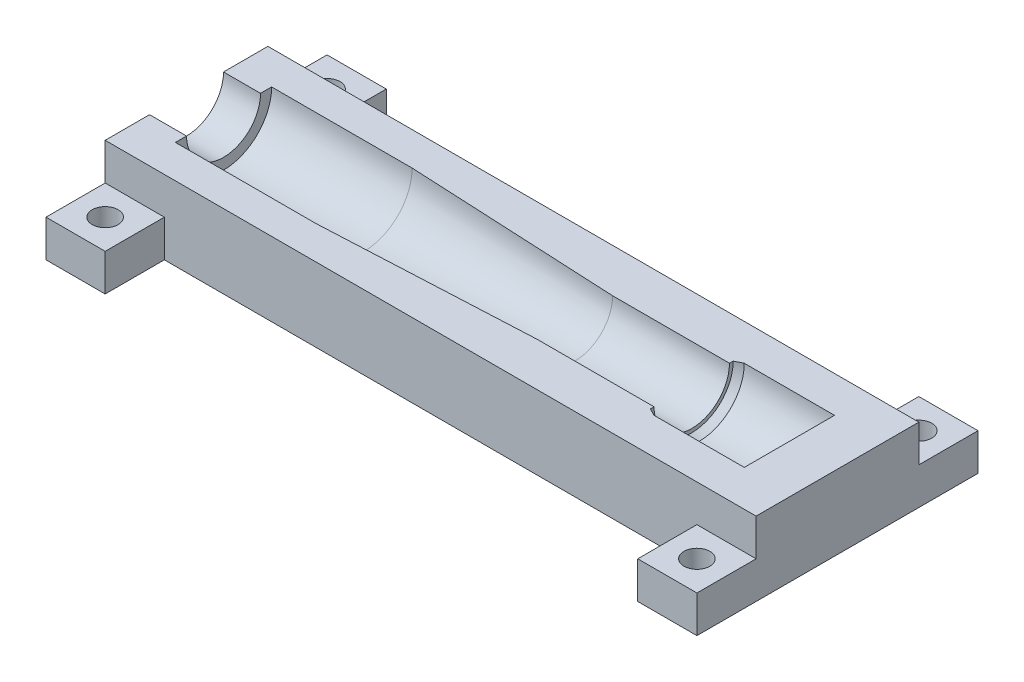
ISO-10303-21;
HEADER;
FILE_DESCRIPTION(('STEP AP214'),'2;1');
FILE_NAME('part.step','',(''),(''),'','','');
FILE_SCHEMA(('AUTOMOTIVE_DESIGN { 1 0 10303 214 1 1 1 1 }'));
ENDSEC;
DATA;
#1=APPLICATION_CONTEXT('core data for automotive mechanical design processes');
#2=APPLICATION_PROTOCOL_DEFINITION('international standard','automotive_design',2000,#1);
#3=PRODUCT_CONTEXT('',#1,'mechanical');
#4=PRODUCT('Part','Part','',(#3));
#5=PRODUCT_RELATED_PRODUCT_CATEGORY('part','',(#4));
#6=PRODUCT_DEFINITION_FORMATION('','',#4);
#7=PRODUCT_DEFINITION_CONTEXT('part definition',#1,'design');
#8=PRODUCT_DEFINITION('design','',#6,#7);
#9=PRODUCT_DEFINITION_SHAPE('','',#8);
#10=(LENGTH_UNIT() NAMED_UNIT(*) SI_UNIT(.MILLI.,.METRE.));
#11=(NAMED_UNIT(*) PLANE_ANGLE_UNIT() SI_UNIT($,.RADIAN.));
#12=(NAMED_UNIT(*) SI_UNIT($,.STERADIAN.) SOLID_ANGLE_UNIT());
#13=UNCERTAINTY_MEASURE_WITH_UNIT(LENGTH_MEASURE(1.E-05),#10,'distance_accuracy_value','');
#14=(GEOMETRIC_REPRESENTATION_CONTEXT(3) GLOBAL_UNCERTAINTY_ASSIGNED_CONTEXT((#13)) GLOBAL_UNIT_ASSIGNED_CONTEXT((#10,
#11,#12)) REPRESENTATION_CONTEXT('',''));
#15=CARTESIAN_POINT('',(0.,0.,0.));
#16=DIRECTION('',(0.,0.,1.));
#17=DIRECTION('',(1.,0.,0.));
#18=AXIS2_PLACEMENT_3D('',#15,#16,#17);
#19=CARTESIAN_POINT('',(0.,0.,0.));
#20=DIRECTION('',(0.,1.,0.));
#21=DIRECTION('',(1.,0.,0.));
#22=AXIS2_PLACEMENT_3D('',#19,#20,#21);
#23=PLANE('',#22);
#24=CARTESIAN_POINT('',(40.,0.,-15.));
#25=DIRECTION('',(0.,-1.,0.));
#26=DIRECTION('',(1.,0.,0.));
#27=AXIS2_PLACEMENT_3D('',#24,#25,#26);
#28=CIRCLE('',#27,1.75);
#29=CARTESIAN_POINT('',(38.25,0.,-15.));
#30=VERTEX_POINT('',#29);
#31=EDGE_CURVE('E384',#30,#30,#28,.T.);
#32=ORIENTED_EDGE('',*,*,#31,.F.);
#33=EDGE_LOOP('',(#32));
#34=FACE_BOUND('',#33,.T.);
#35=CARTESIAN_POINT('',(-40.,0.,-15.));
#36=DIRECTION('',(0.,-1.,0.));
#37=DIRECTION('',(1.,0.,0.));
#38=AXIS2_PLACEMENT_3D('',#35,#36,#37);
#39=CIRCLE('',#38,1.75);
#40=CARTESIAN_POINT('',(-41.75,0.,-15.));
#41=VERTEX_POINT('',#40);
#42=EDGE_CURVE('E322',#41,#41,#39,.T.);
#43=ORIENTED_EDGE('',*,*,#42,.F.);
#44=EDGE_LOOP('',(#43));
#45=FACE_BOUND('',#44,.T.);
#46=CARTESIAN_POINT('',(40.,0.,15.));
#47=DIRECTION('',(0.,-1.,0.));
#48=DIRECTION('',(1.,0.,0.));
#49=AXIS2_PLACEMENT_3D('',#46,#47,#48);
#50=CIRCLE('',#49,1.75);
#51=CARTESIAN_POINT('',(38.25,0.,15.));
#52=VERTEX_POINT('',#51);
#53=EDGE_CURVE('E313',#52,#52,#50,.T.);
#54=ORIENTED_EDGE('',*,*,#53,.F.);
#55=EDGE_LOOP('',(#54));
#56=FACE_BOUND('',#55,.T.);
#57=CARTESIAN_POINT('',(-40.,0.,15.));
#58=DIRECTION('',(0.,-1.,0.));
#59=DIRECTION('',(1.,0.,0.));
#60=AXIS2_PLACEMENT_3D('',#57,#58,#59);
#61=CIRCLE('',#60,1.75);
#62=CARTESIAN_POINT('',(-41.75,0.,15.));
#63=VERTEX_POINT('',#62);
#64=EDGE_CURVE('E426',#63,#63,#61,.T.);
#65=ORIENTED_EDGE('',*,*,#64,.F.);
#66=EDGE_LOOP('',(#65));
#67=FACE_BOUND('',#66,.T.);
#68=DIRECTION('',(0.,0.,-1.));
#69=VECTOR('',#68,1.);
#70=CARTESIAN_POINT('',(44.,0.,19.));
#71=LINE('',#70,#69);
#72=CARTESIAN_POINT('',(44.,0.,19.));
#73=VERTEX_POINT('',#72);
#74=CARTESIAN_POINT('',(44.,0.,-19.));
#75=VERTEX_POINT('',#74);
#76=EDGE_CURVE('E509',#73,#75,#71,.T.);
#77=ORIENTED_EDGE('',*,*,#76,.F.);
#78=DIRECTION('',(1.,0.,0.));
#79=VECTOR('',#78,1.);
#80=CARTESIAN_POINT('',(36.,0.,19.));
#81=LINE('',#80,#79);
#82=CARTESIAN_POINT('',(36.,0.,19.));
#83=VERTEX_POINT('',#82);
#84=EDGE_CURVE('E315',#83,#73,#81,.T.);
#85=ORIENTED_EDGE('',*,*,#84,.F.);
#86=DIRECTION('',(0.,0.,1.));
#87=VECTOR('',#86,1.);
#88=CARTESIAN_POINT('',(36.,0.,11.));
#89=LINE('',#88,#87);
#90=CARTESIAN_POINT('',(36.,0.,11.));
#91=VERTEX_POINT('',#90);
#92=EDGE_CURVE('E306',#91,#83,#89,.T.);
#93=ORIENTED_EDGE('',*,*,#92,.F.);
#94=DIRECTION('',(1.,0.,0.));
#95=VECTOR('',#94,1.);
#96=CARTESIAN_POINT('',(-44.,0.,11.));
#97=LINE('',#96,#95);
#98=CARTESIAN_POINT('',(-36.,0.,11.));
#99=VERTEX_POINT('',#98);
#100=EDGE_CURVE('E152',#99,#91,#97,.T.);
#101=ORIENTED_EDGE('',*,*,#100,.F.);
#102=DIRECTION('',(0.,0.,-1.));
#103=VECTOR('',#102,1.);
#104=CARTESIAN_POINT('',(-36.,0.,19.));
#105=LINE('',#104,#103);
#106=CARTESIAN_POINT('',(-36.,0.,19.));
#107=VERTEX_POINT('',#106);
#108=EDGE_CURVE('E372',#107,#99,#105,.T.);
#109=ORIENTED_EDGE('',*,*,#108,.F.);
#110=DIRECTION('',(1.,0.,0.));
#111=VECTOR('',#110,1.);
#112=CARTESIAN_POINT('',(-44.,0.,19.));
#113=LINE('',#112,#111);
#114=CARTESIAN_POINT('',(-44.,0.,19.));
#115=VERTEX_POINT('',#114);
#116=EDGE_CURVE('E368',#115,#107,#113,.T.);
#117=ORIENTED_EDGE('',*,*,#116,.F.);
#118=DIRECTION('',(0.,0.,1.));
#119=VECTOR('',#118,1.);
#120=CARTESIAN_POINT('',(-44.,0.,-19.));
#121=LINE('',#120,#119);
#122=CARTESIAN_POINT('',(-44.,0.,-19.));
#123=VERTEX_POINT('',#122);
#124=EDGE_CURVE('E452',#123,#115,#121,.T.);
#125=ORIENTED_EDGE('',*,*,#124,.F.);
#126=DIRECTION('',(-1.,0.,0.));
#127=VECTOR('',#126,1.);
#128=CARTESIAN_POINT('',(-36.,0.,-19.));
#129=LINE('',#128,#127);
#130=CARTESIAN_POINT('',(-36.,0.,-19.));
#131=VERTEX_POINT('',#130);
#132=EDGE_CURVE('E371',#131,#123,#129,.T.);
#133=ORIENTED_EDGE('',*,*,#132,.F.);
#134=DIRECTION('',(0.,0.,-1.));
#135=VECTOR('',#134,1.);
#136=CARTESIAN_POINT('',(-36.,0.,-11.));
#137=LINE('',#136,#135);
#138=CARTESIAN_POINT('',(-36.,0.,-11.));
#139=VERTEX_POINT('',#138);
#140=EDGE_CURVE('E308',#139,#131,#137,.T.);
#141=ORIENTED_EDGE('',*,*,#140,.F.);
#142=DIRECTION('',(-1.,0.,0.));
#143=VECTOR('',#142,1.);
#144=CARTESIAN_POINT('',(44.,0.,-11.));
#145=LINE('',#144,#143);
#146=CARTESIAN_POINT('',(36.,0.,-11.));
#147=VERTEX_POINT('',#146);
#148=EDGE_CURVE('E10',#147,#139,#145,.T.);
#149=ORIENTED_EDGE('',*,*,#148,.F.);
#150=DIRECTION('',(0.,0.,1.));
#151=VECTOR('',#150,1.);
#152=CARTESIAN_POINT('',(36.,0.,-19.));
#153=LINE('',#152,#151);
#154=CARTESIAN_POINT('',(36.,0.,-19.));
#155=VERTEX_POINT('',#154);
#156=EDGE_CURVE('E348',#155,#147,#153,.T.);
#157=ORIENTED_EDGE('',*,*,#156,.F.);
#158=DIRECTION('',(-1.,0.,0.));
#159=VECTOR('',#158,1.);
#160=CARTESIAN_POINT('',(44.,0.,-19.));
#161=LINE('',#160,#159);
#162=EDGE_CURVE('E440',#75,#155,#161,.T.);
#163=ORIENTED_EDGE('',*,*,#162,.F.);
#164=EDGE_LOOP('',(#77,#85,#93,#101,#109,#117,#125,#133,#141,#149,#157,#163));
#165=FACE_BOUND('',#164,.T.);
#166=ADVANCED_FACE('F16',(#34,#45,#56,#67,#165),#23,.F.);
#167=CARTESIAN_POINT('',(0.,10.,0.));
#168=DIRECTION('',(0.,1.,0.));
#169=DIRECTION('',(1.,0.,0.));
#170=AXIS2_PLACEMENT_3D('',#167,#168,#169);
#171=PLANE('',#170);
#172=DIRECTION('',(-1.,0.,0.));
#173=VECTOR('',#172,1.);
#174=CARTESIAN_POINT('',(-41.5,10.,5.));
#175=LINE('',#174,#173);
#176=CARTESIAN_POINT('',(-39.,10.,5.));
#177=VERTEX_POINT('',#176);
#178=CARTESIAN_POINT('',(-44.,10.,5.));
#179=VERTEX_POINT('',#178);
#180=EDGE_CURVE('E403',#177,#179,#175,.T.);
#181=ORIENTED_EDGE('',*,*,#180,.T.);
#182=DIRECTION('',(0.,0.,1.));
#183=VECTOR('',#182,1.);
#184=CARTESIAN_POINT('',(-44.,10.,-11.));
#185=LINE('',#184,#183);
#186=CARTESIAN_POINT('',(-44.,10.,11.));
#187=VERTEX_POINT('',#186);
#188=EDGE_CURVE('E472',#179,#187,#185,.T.);
#189=ORIENTED_EDGE('',*,*,#188,.T.);
#190=DIRECTION('',(1.,0.,0.));
#191=VECTOR('',#190,1.);
#192=CARTESIAN_POINT('',(-44.,10.,11.));
#193=LINE('',#192,#191);
#194=CARTESIAN_POINT('',(44.,10.,11.));
#195=VERTEX_POINT('',#194);
#196=EDGE_CURVE('E41',#187,#195,#193,.T.);
#197=ORIENTED_EDGE('',*,*,#196,.T.);
#198=DIRECTION('',(0.,0.,-1.));
#199=VECTOR('',#198,1.);
#200=CARTESIAN_POINT('',(44.,10.,11.));
#201=LINE('',#200,#199);
#202=CARTESIAN_POINT('',(44.,10.,-11.));
#203=VERTEX_POINT('',#202);
#204=EDGE_CURVE('E327',#195,#203,#201,.T.);
#205=ORIENTED_EDGE('',*,*,#204,.T.);
#206=DIRECTION('',(-1.,0.,0.));
#207=VECTOR('',#206,1.);
#208=CARTESIAN_POINT('',(44.,10.,-11.));
#209=LINE('',#208,#207);
#210=CARTESIAN_POINT('',(-44.,10.,-11.));
#211=VERTEX_POINT('',#210);
#212=EDGE_CURVE('E27',#203,#211,#209,.T.);
#213=ORIENTED_EDGE('',*,*,#212,.T.);
#214=DIRECTION('',(0.,0.,1.));
#215=VECTOR('',#214,1.);
#216=CARTESIAN_POINT('',(-44.,10.,-11.));
#217=LINE('',#216,#215);
#218=CARTESIAN_POINT('',(-44.,10.,-5.));
#219=VERTEX_POINT('',#218);
#220=EDGE_CURVE('E447',#211,#219,#217,.T.);
#221=ORIENTED_EDGE('',*,*,#220,.T.);
#222=DIRECTION('',(1.,0.,0.));
#223=VECTOR('',#222,1.);
#224=CARTESIAN_POINT('',(-41.5,10.,-5.));
#225=LINE('',#224,#223);
#226=CARTESIAN_POINT('',(-39.,10.,-5.));
#227=VERTEX_POINT('',#226);
#228=EDGE_CURVE('E398',#219,#227,#225,.T.);
#229=ORIENTED_EDGE('',*,*,#228,.T.);
#230=DIRECTION('',(0.,0.,-1.));
#231=VECTOR('',#230,1.);
#232=CARTESIAN_POINT('',(-39.,10.,-2.5));
#233=LINE('',#232,#231);
#234=CARTESIAN_POINT('',(-39.,10.,-6.5));
#235=VERTEX_POINT('',#234);
#236=EDGE_CURVE('E486',#227,#235,#233,.T.);
#237=ORIENTED_EDGE('',*,*,#236,.T.);
#238=DIRECTION('',(1.,0.,0.));
#239=VECTOR('',#238,1.);
#240=CARTESIAN_POINT('',(-29.5,10.,-6.5));
#241=LINE('',#240,#239);
#242=CARTESIAN_POINT('',(-20.,10.,-6.5));
#243=VERTEX_POINT('',#242);
#244=EDGE_CURVE('E418',#235,#243,#241,.T.);
#245=ORIENTED_EDGE('',*,*,#244,.T.);
#246=DIRECTION('',(0.998795654087924,0.,0.0490636461657227));
#247=VECTOR('',#246,1.);
#248=CARTESIAN_POINT('',(-5.75,10.,-5.8));
#249=LINE('',#248,#247);
#250=CARTESIAN_POINT('',(8.5,10.,-5.1));
#251=VERTEX_POINT('',#250);
#252=EDGE_CURVE('E448',#243,#251,#249,.T.);
#253=ORIENTED_EDGE('',*,*,#252,.T.);
#254=DIRECTION('',(1.,0.,0.));
#255=VECTOR('',#254,1.);
#256=CARTESIAN_POINT('',(16.4,10.,-5.1));
#257=LINE('',#256,#255);
#258=CARTESIAN_POINT('',(24.3,10.,-5.1));
#259=VERTEX_POINT('',#258);
#260=EDGE_CURVE('E391',#251,#259,#257,.T.);
#261=ORIENTED_EDGE('',*,*,#260,.T.);
#262=DIRECTION('',(0.,0.,-1.));
#263=VECTOR('',#262,1.);
#264=CARTESIAN_POINT('',(24.3,10.,-2.55));
#265=LINE('',#264,#263);
#266=CARTESIAN_POINT('',(24.3,10.,-5.6));
#267=VERTEX_POINT('',#266);
#268=EDGE_CURVE('E287',#259,#267,#265,.T.);
#269=ORIENTED_EDGE('',*,*,#268,.T.);
#270=DIRECTION('',(0.894427190999917,0.,-0.447213595499956));
#271=VECTOR('',#270,1.);
#272=CARTESIAN_POINT('',(24.8,10.,-5.85));
#273=LINE('',#272,#271);
#274=CARTESIAN_POINT('',(25.3,10.,-6.1));
#275=VERTEX_POINT('',#274);
#276=EDGE_CURVE('E277',#267,#275,#273,.T.);
#277=ORIENTED_EDGE('',*,*,#276,.T.);
#278=DIRECTION('',(1.,0.,0.));
#279=VECTOR('',#278,1.);
#280=CARTESIAN_POINT('',(31.4,10.,-6.1));
#281=LINE('',#280,#279);
#282=CARTESIAN_POINT('',(37.5,10.,-6.1));
#283=VERTEX_POINT('',#282);
#284=EDGE_CURVE('E361',#275,#283,#281,.T.);
#285=ORIENTED_EDGE('',*,*,#284,.T.);
#286=DIRECTION('',(0.,0.,1.));
#287=VECTOR('',#286,1.);
#288=CARTESIAN_POINT('',(37.5,10.,-3.05));
#289=LINE('',#288,#287);
#290=CARTESIAN_POINT('',(37.5,10.,6.1));
#291=VERTEX_POINT('',#290);
#292=EDGE_CURVE('E433',#283,#291,#289,.T.);
#293=ORIENTED_EDGE('',*,*,#292,.T.);
#294=DIRECTION('',(-1.,0.,0.));
#295=VECTOR('',#294,1.);
#296=CARTESIAN_POINT('',(31.4,10.,6.1));
#297=LINE('',#296,#295);
#298=CARTESIAN_POINT('',(25.3,10.,6.1));
#299=VERTEX_POINT('',#298);
#300=EDGE_CURVE('E272',#291,#299,#297,.T.);
#301=ORIENTED_EDGE('',*,*,#300,.T.);
#302=DIRECTION('',(-0.894427190999917,0.,-0.447213595499956));
#303=VECTOR('',#302,1.);
#304=CARTESIAN_POINT('',(24.8,10.,5.85));
#305=LINE('',#304,#303);
#306=CARTESIAN_POINT('',(24.3,10.,5.6));
#307=VERTEX_POINT('',#306);
#308=EDGE_CURVE('E264',#299,#307,#305,.T.);
#309=ORIENTED_EDGE('',*,*,#308,.T.);
#310=DIRECTION('',(0.,0.,-1.));
#311=VECTOR('',#310,1.);
#312=CARTESIAN_POINT('',(24.3,10.,-2.55));
#313=LINE('',#312,#311);
#314=CARTESIAN_POINT('',(24.3,10.,5.1));
#315=VERTEX_POINT('',#314);
#316=EDGE_CURVE('E270',#307,#315,#313,.T.);
#317=ORIENTED_EDGE('',*,*,#316,.T.);
#318=DIRECTION('',(-1.,0.,0.));
#319=VECTOR('',#318,1.);
#320=CARTESIAN_POINT('',(16.4,10.,5.1));
#321=LINE('',#320,#319);
#322=CARTESIAN_POINT('',(8.5,10.,5.1));
#323=VERTEX_POINT('',#322);
#324=EDGE_CURVE('E386',#315,#323,#321,.T.);
#325=ORIENTED_EDGE('',*,*,#324,.T.);
#326=DIRECTION('',(-0.998795654087924,0.,0.0490636461657227));
#327=VECTOR('',#326,1.);
#328=CARTESIAN_POINT('',(-5.75,10.,5.8));
#329=LINE('',#328,#327);
#330=CARTESIAN_POINT('',(-20.,10.,6.5));
#331=VERTEX_POINT('',#330);
#332=EDGE_CURVE('E300',#323,#331,#329,.T.);
#333=ORIENTED_EDGE('',*,*,#332,.T.);
#334=DIRECTION('',(-1.,0.,0.));
#335=VECTOR('',#334,1.);
#336=CARTESIAN_POINT('',(-29.5,10.,6.5));
#337=LINE('',#336,#335);
#338=CARTESIAN_POINT('',(-39.,10.,6.5));
#339=VERTEX_POINT('',#338);
#340=EDGE_CURVE('E463',#331,#339,#337,.T.);
#341=ORIENTED_EDGE('',*,*,#340,.T.);
#342=DIRECTION('',(0.,0.,-1.));
#343=VECTOR('',#342,1.);
#344=CARTESIAN_POINT('',(-39.,10.,-2.5));
#345=LINE('',#344,#343);
#346=EDGE_CURVE('E417',#339,#177,#345,.T.);
#347=ORIENTED_EDGE('',*,*,#346,.T.);
#348=EDGE_LOOP('',(#181,#189,#197,#205,#213,#221,#229,#237,#245,#253,#261,#269,#277,#285,#293,
#301,#309,#317,#325,#333,#341,#347));
#349=FACE_BOUND('',#348,.T.);
#350=ADVANCED_FACE('F267',(#349),#171,.T.);
#351=CARTESIAN_POINT('',(44.,0.,-11.));
#352=DIRECTION('',(0.,0.,-1.));
#353=DIRECTION('',(0.,-1.,0.));
#354=AXIS2_PLACEMENT_3D('',#351,#352,#353);
#355=PLANE('',#354);
#356=DIRECTION('',(-1.,0.,0.));
#357=VECTOR('',#356,1.);
#358=CARTESIAN_POINT('',(2.,5.,-11.));
#359=LINE('',#358,#357);
#360=CARTESIAN_POINT('',(-36.,5.,-11.));
#361=VERTEX_POINT('',#360);
#362=CARTESIAN_POINT('',(-44.,5.,-11.));
#363=VERTEX_POINT('',#362);
#364=EDGE_CURVE('E94',#361,#363,#359,.T.);
#365=ORIENTED_EDGE('',*,*,#364,.T.);
#366=DIRECTION('',(0.,1.,0.));
#367=VECTOR('',#366,1.);
#368=CARTESIAN_POINT('',(-44.,0.,-11.));
#369=LINE('',#368,#367);
#370=EDGE_CURVE('E438',#363,#211,#369,.T.);
#371=ORIENTED_EDGE('',*,*,#370,.T.);
#372=ORIENTED_EDGE('',*,*,#212,.F.);
#373=DIRECTION('',(0.,1.,0.));
#374=VECTOR('',#373,1.);
#375=CARTESIAN_POINT('',(44.,0.,-11.));
#376=LINE('',#375,#374);
#377=CARTESIAN_POINT('',(44.,5.,-11.));
#378=VERTEX_POINT('',#377);
#379=EDGE_CURVE('E458',#378,#203,#376,.T.);
#380=ORIENTED_EDGE('',*,*,#379,.F.);
#381=DIRECTION('',(-1.,0.,0.));
#382=VECTOR('',#381,1.);
#383=CARTESIAN_POINT('',(42.,5.,-11.));
#384=LINE('',#383,#382);
#385=CARTESIAN_POINT('',(36.,5.,-11.));
#386=VERTEX_POINT('',#385);
#387=EDGE_CURVE('E334',#378,#386,#384,.T.);
#388=ORIENTED_EDGE('',*,*,#387,.T.);
#389=DIRECTION('',(0.,-1.,0.));
#390=VECTOR('',#389,1.);
#391=CARTESIAN_POINT('',(36.,0.,-11.));
#392=LINE('',#391,#390);
#393=EDGE_CURVE('E335',#386,#147,#392,.T.);
#394=ORIENTED_EDGE('',*,*,#393,.T.);
#395=ORIENTED_EDGE('',*,*,#148,.T.);
#396=DIRECTION('',(0.,1.,0.));
#397=VECTOR('',#396,1.);
#398=CARTESIAN_POINT('',(-36.,0.,-11.));
#399=LINE('',#398,#397);
#400=EDGE_CURVE('E477',#139,#361,#399,.T.);
#401=ORIENTED_EDGE('',*,*,#400,.T.);
#402=EDGE_LOOP('',(#365,#371,#372,#380,#388,#394,#395,#401));
#403=FACE_BOUND('',#402,.T.);
#404=ADVANCED_FACE('F528',(#403),#355,.T.);
#405=CARTESIAN_POINT('',(-44.,0.,11.));
#406=DIRECTION('',(0.,0.,1.));
#407=DIRECTION('',(1.,0.,0.));
#408=AXIS2_PLACEMENT_3D('',#405,#406,#407);
#409=PLANE('',#408);
#410=DIRECTION('',(0.,-1.,0.));
#411=VECTOR('',#410,1.);
#412=CARTESIAN_POINT('',(-36.,0.,11.));
#413=LINE('',#412,#411);
#414=CARTESIAN_POINT('',(-36.,5.,11.));
#415=VERTEX_POINT('',#414);
#416=EDGE_CURVE('E376',#415,#99,#413,.T.);
#417=ORIENTED_EDGE('',*,*,#416,.T.);
#418=ORIENTED_EDGE('',*,*,#100,.T.);
#419=DIRECTION('',(0.,1.,0.));
#420=VECTOR('',#419,1.);
#421=CARTESIAN_POINT('',(36.,0.,11.));
#422=LINE('',#421,#420);
#423=CARTESIAN_POINT('',(36.,5.,11.));
#424=VERTEX_POINT('',#423);
#425=EDGE_CURVE('E409',#91,#424,#422,.T.);
#426=ORIENTED_EDGE('',*,*,#425,.T.);
#427=DIRECTION('',(1.,0.,0.));
#428=VECTOR('',#427,1.);
#429=CARTESIAN_POINT('',(-2.,5.,11.));
#430=LINE('',#429,#428);
#431=CARTESIAN_POINT('',(44.,5.,11.));
#432=VERTEX_POINT('',#431);
#433=EDGE_CURVE('E137',#424,#432,#430,.T.);
#434=ORIENTED_EDGE('',*,*,#433,.T.);
#435=DIRECTION('',(0.,1.,0.));
#436=VECTOR('',#435,1.);
#437=CARTESIAN_POINT('',(44.,0.,11.));
#438=LINE('',#437,#436);
#439=EDGE_CURVE('E324',#432,#195,#438,.T.);
#440=ORIENTED_EDGE('',*,*,#439,.T.);
#441=ORIENTED_EDGE('',*,*,#196,.F.);
#442=DIRECTION('',(0.,1.,0.));
#443=VECTOR('',#442,1.);
#444=CARTESIAN_POINT('',(-44.,0.,11.));
#445=LINE('',#444,#443);
#446=CARTESIAN_POINT('',(-44.,5.,11.));
#447=VERTEX_POINT('',#446);
#448=EDGE_CURVE('E487',#447,#187,#445,.T.);
#449=ORIENTED_EDGE('',*,*,#448,.F.);
#450=DIRECTION('',(1.,0.,0.));
#451=VECTOR('',#450,1.);
#452=CARTESIAN_POINT('',(-42.,5.,11.));
#453=LINE('',#452,#451);
#454=EDGE_CURVE('E408',#447,#415,#453,.T.);
#455=ORIENTED_EDGE('',*,*,#454,.T.);
#456=EDGE_LOOP('',(#417,#418,#426,#434,#440,#441,#449,#455));
#457=FACE_BOUND('',#456,.T.);
#458=ADVANCED_FACE('F633',(#457),#409,.T.);
#459=CARTESIAN_POINT('',(44.,0.,11.));
#460=DIRECTION('',(1.,0.,0.));
#461=DIRECTION('',(0.,1.,0.));
#462=AXIS2_PLACEMENT_3D('',#459,#460,#461);
#463=PLANE('',#462);
#464=ORIENTED_EDGE('',*,*,#76,.T.);
#465=DIRECTION('',(0.,1.,0.));
#466=VECTOR('',#465,1.);
#467=CARTESIAN_POINT('',(44.,0.,-19.));
#468=LINE('',#467,#466);
#469=CARTESIAN_POINT('',(44.,5.,-19.));
#470=VERTEX_POINT('',#469);
#471=EDGE_CURVE('E354',#75,#470,#468,.T.);
#472=ORIENTED_EDGE('',*,*,#471,.T.);
#473=DIRECTION('',(0.,0.,-1.));
#474=VECTOR('',#473,1.);
#475=CARTESIAN_POINT('',(44.,5.,-11.));
#476=LINE('',#475,#474);
#477=EDGE_CURVE('E345',#378,#470,#476,.T.);
#478=ORIENTED_EDGE('',*,*,#477,.F.);
#479=ORIENTED_EDGE('',*,*,#379,.T.);
#480=ORIENTED_EDGE('',*,*,#204,.F.);
#481=ORIENTED_EDGE('',*,*,#439,.F.);
#482=DIRECTION('',(0.,0.,-1.));
#483=VECTOR('',#482,1.);
#484=CARTESIAN_POINT('',(44.,5.,19.));
#485=LINE('',#484,#483);
#486=CARTESIAN_POINT('',(44.,5.,19.));
#487=VERTEX_POINT('',#486);
#488=EDGE_CURVE('E498',#487,#432,#485,.T.);
#489=ORIENTED_EDGE('',*,*,#488,.F.);
#490=DIRECTION('',(0.,1.,0.));
#491=VECTOR('',#490,1.);
#492=CARTESIAN_POINT('',(44.,0.,19.));
#493=LINE('',#492,#491);
#494=EDGE_CURVE('E330',#73,#487,#493,.T.);
#495=ORIENTED_EDGE('',*,*,#494,.F.);
#496=EDGE_LOOP('',(#464,#472,#478,#479,#480,#481,#489,#495));
#497=FACE_BOUND('',#496,.T.);
#498=ADVANCED_FACE('F630',(#497),#463,.T.);
#499=CARTESIAN_POINT('',(40.,5.,-15.));
#500=DIRECTION('',(0.,1.,0.));
#501=DIRECTION('',(1.,0.,0.));
#502=AXIS2_PLACEMENT_3D('',#499,#500,#501);
#503=PLANE('',#502);
#504=CARTESIAN_POINT('',(40.,5.,-15.));
#505=DIRECTION('',(0.,-1.,0.));
#506=DIRECTION('',(1.,0.,0.));
#507=AXIS2_PLACEMENT_3D('',#504,#505,#506);
#508=CIRCLE('',#507,1.75);
#509=CARTESIAN_POINT('',(38.25,5.,-15.));
#510=VERTEX_POINT('',#509);
#511=EDGE_CURVE('E377',#510,#510,#508,.T.);
#512=ORIENTED_EDGE('',*,*,#511,.T.);
#513=EDGE_LOOP('',(#512));
#514=FACE_BOUND('',#513,.T.);
#515=DIRECTION('',(0.,0.,1.));
#516=VECTOR('',#515,1.);
#517=CARTESIAN_POINT('',(36.,5.,-19.));
#518=LINE('',#517,#516);
#519=CARTESIAN_POINT('',(36.,5.,-19.));
#520=VERTEX_POINT('',#519);
#521=EDGE_CURVE('E331',#520,#386,#518,.T.);
#522=ORIENTED_EDGE('',*,*,#521,.T.);
#523=ORIENTED_EDGE('',*,*,#387,.F.);
#524=ORIENTED_EDGE('',*,*,#477,.T.);
#525=DIRECTION('',(-1.,0.,0.));
#526=VECTOR('',#525,1.);
#527=CARTESIAN_POINT('',(44.,5.,-19.));
#528=LINE('',#527,#526);
#529=EDGE_CURVE('E419',#470,#520,#528,.T.);
#530=ORIENTED_EDGE('',*,*,#529,.T.);
#531=EDGE_LOOP('',(#522,#523,#524,#530));
#532=FACE_BOUND('',#531,.T.);
#533=ADVANCED_FACE('F608',(#514,#532),#503,.T.);
#534=CARTESIAN_POINT('',(36.,0.,-19.));
#535=DIRECTION('',(-1.,0.,0.));
#536=DIRECTION('',(0.,0.,1.));
#537=AXIS2_PLACEMENT_3D('',#534,#535,#536);
#538=PLANE('',#537);
#539=ORIENTED_EDGE('',*,*,#156,.T.);
#540=ORIENTED_EDGE('',*,*,#393,.F.);
#541=ORIENTED_EDGE('',*,*,#521,.F.);
#542=DIRECTION('',(0.,1.,0.));
#543=VECTOR('',#542,1.);
#544=CARTESIAN_POINT('',(36.,0.,-19.));
#545=LINE('',#544,#543);
#546=EDGE_CURVE('E422',#155,#520,#545,.T.);
#547=ORIENTED_EDGE('',*,*,#546,.F.);
#548=EDGE_LOOP('',(#539,#540,#541,#547));
#549=FACE_BOUND('',#548,.T.);
#550=ADVANCED_FACE('F605',(#549),#538,.T.);
#551=CARTESIAN_POINT('',(44.,0.,-19.));
#552=DIRECTION('',(0.,0.,-1.));
#553=DIRECTION('',(-1.,0.,0.));
#554=AXIS2_PLACEMENT_3D('',#551,#552,#553);
#555=PLANE('',#554);
#556=ORIENTED_EDGE('',*,*,#162,.T.);
#557=ORIENTED_EDGE('',*,*,#546,.T.);
#558=ORIENTED_EDGE('',*,*,#529,.F.);
#559=ORIENTED_EDGE('',*,*,#471,.F.);
#560=EDGE_LOOP('',(#556,#557,#558,#559));
#561=FACE_BOUND('',#560,.T.);
#562=ADVANCED_FACE('F607',(#561),#555,.T.);
#563=CARTESIAN_POINT('',(40.,0.,-15.));
#564=DIRECTION('',(0.,1.,0.));
#565=DIRECTION('',(1.,0.,0.));
#566=AXIS2_PLACEMENT_3D('',#563,#564,#565);
#567=CYLINDRICAL_SURFACE('',#566,1.75);
#568=ORIENTED_EDGE('',*,*,#511,.F.);
#569=DIRECTION('',(0.,-1.,0.));
#570=VECTOR('',#569,1.);
#571=CARTESIAN_POINT('',(38.25,0.,-15.));
#572=LINE('',#571,#570);
#573=EDGE_CURVE('E381',#510,#30,#572,.T.);
#574=ORIENTED_EDGE('',*,*,#573,.T.);
#575=ORIENTED_EDGE('',*,*,#31,.T.);
#576=ORIENTED_EDGE('',*,*,#573,.F.);
#577=EDGE_LOOP('',(#568,#574,#575,#576));
#578=FACE_BOUND('',#577,.T.);
#579=ADVANCED_FACE('F866',(#578),#567,.F.);
#580=CARTESIAN_POINT('',(-40.,5.,-15.));
#581=DIRECTION('',(0.,1.,0.));
#582=DIRECTION('',(1.,0.,0.));
#583=AXIS2_PLACEMENT_3D('',#580,#581,#582);
#584=PLANE('',#583);
#585=CARTESIAN_POINT('',(-40.,5.,-15.));
#586=DIRECTION('',(0.,-1.,0.));
#587=DIRECTION('',(1.,0.,0.));
#588=AXIS2_PLACEMENT_3D('',#585,#586,#587);
#589=CIRCLE('',#588,1.75);
#590=CARTESIAN_POINT('',(-41.75,5.,-15.));
#591=VERTEX_POINT('',#590);
#592=EDGE_CURVE('E323',#591,#591,#589,.T.);
#593=ORIENTED_EDGE('',*,*,#592,.T.);
#594=EDGE_LOOP('',(#593));
#595=FACE_BOUND('',#594,.T.);
#596=ORIENTED_EDGE('',*,*,#364,.F.);
#597=DIRECTION('',(0.,0.,-1.));
#598=VECTOR('',#597,1.);
#599=CARTESIAN_POINT('',(-36.,5.,-11.));
#600=LINE('',#599,#598);
#601=CARTESIAN_POINT('',(-36.,5.,-19.));
#602=VERTEX_POINT('',#601);
#603=EDGE_CURVE('E20',#361,#602,#600,.T.);
#604=ORIENTED_EDGE('',*,*,#603,.T.);
#605=DIRECTION('',(-1.,0.,0.));
#606=VECTOR('',#605,1.);
#607=CARTESIAN_POINT('',(-36.,5.,-19.));
#608=LINE('',#607,#606);
#609=CARTESIAN_POINT('',(-44.,5.,-19.));
#610=VERTEX_POINT('',#609);
#611=EDGE_CURVE('E78',#602,#610,#608,.T.);
#612=ORIENTED_EDGE('',*,*,#611,.T.);
#613=DIRECTION('',(0.,0.,1.));
#614=VECTOR('',#613,1.);
#615=CARTESIAN_POINT('',(-44.,5.,-19.));
#616=LINE('',#615,#614);
#617=EDGE_CURVE('E434',#610,#363,#616,.T.);
#618=ORIENTED_EDGE('',*,*,#617,.T.);
#619=EDGE_LOOP('',(#596,#604,#612,#618));
#620=FACE_BOUND('',#619,.T.);
#621=ADVANCED_FACE('F18',(#595,#620),#584,.T.);
#622=CARTESIAN_POINT('',(-36.,0.,-11.));
#623=DIRECTION('',(1.,0.,0.));
#624=DIRECTION('',(0.,1.,0.));
#625=AXIS2_PLACEMENT_3D('',#622,#623,#624);
#626=PLANE('',#625);
#627=ORIENTED_EDGE('',*,*,#140,.T.);
#628=DIRECTION('',(0.,1.,0.));
#629=VECTOR('',#628,1.);
#630=CARTESIAN_POINT('',(-36.,0.,-19.));
#631=LINE('',#630,#629);
#632=EDGE_CURVE('E312',#131,#602,#631,.T.);
#633=ORIENTED_EDGE('',*,*,#632,.T.);
#634=ORIENTED_EDGE('',*,*,#603,.F.);
#635=ORIENTED_EDGE('',*,*,#400,.F.);
#636=EDGE_LOOP('',(#627,#633,#634,#635));
#637=FACE_BOUND('',#636,.T.);
#638=ADVANCED_FACE('F648',(#637),#626,.T.);
#639=CARTESIAN_POINT('',(-36.,0.,-19.));
#640=DIRECTION('',(0.,0.,-1.));
#641=DIRECTION('',(0.,-1.,0.));
#642=AXIS2_PLACEMENT_3D('',#639,#640,#641);
#643=PLANE('',#642);
#644=ORIENTED_EDGE('',*,*,#132,.T.);
#645=DIRECTION('',(0.,1.,0.));
#646=VECTOR('',#645,1.);
#647=CARTESIAN_POINT('',(-44.,0.,-19.));
#648=LINE('',#647,#646);
#649=EDGE_CURVE('E437',#123,#610,#648,.T.);
#650=ORIENTED_EDGE('',*,*,#649,.T.);
#651=ORIENTED_EDGE('',*,*,#611,.F.);
#652=ORIENTED_EDGE('',*,*,#632,.F.);
#653=EDGE_LOOP('',(#644,#650,#651,#652));
#654=FACE_BOUND('',#653,.T.);
#655=ADVANCED_FACE('F589',(#654),#643,.T.);
#656=CARTESIAN_POINT('',(-40.,0.,-15.));
#657=DIRECTION('',(0.,1.,0.));
#658=DIRECTION('',(1.,0.,0.));
#659=AXIS2_PLACEMENT_3D('',#656,#657,#658);
#660=CYLINDRICAL_SURFACE('',#659,1.75);
#661=ORIENTED_EDGE('',*,*,#592,.F.);
#662=DIRECTION('',(0.,-1.,0.));
#663=VECTOR('',#662,1.);
#664=CARTESIAN_POINT('',(-41.75,0.,-15.));
#665=LINE('',#664,#663);
#666=EDGE_CURVE('E318',#591,#41,#665,.T.);
#667=ORIENTED_EDGE('',*,*,#666,.T.);
#668=ORIENTED_EDGE('',*,*,#42,.T.);
#669=ORIENTED_EDGE('',*,*,#666,.F.);
#670=EDGE_LOOP('',(#661,#667,#668,#669));
#671=FACE_BOUND('',#670,.T.);
#672=ADVANCED_FACE('F579',(#671),#660,.F.);
#673=CARTESIAN_POINT('',(40.,5.,15.));
#674=DIRECTION('',(0.,1.,0.));
#675=DIRECTION('',(1.,0.,0.));
#676=AXIS2_PLACEMENT_3D('',#673,#674,#675);
#677=PLANE('',#676);
#678=CARTESIAN_POINT('',(40.,5.,15.));
#679=DIRECTION('',(0.,-1.,0.));
#680=DIRECTION('',(1.,0.,0.));
#681=AXIS2_PLACEMENT_3D('',#678,#679,#680);
#682=CIRCLE('',#681,1.75);
#683=CARTESIAN_POINT('',(38.25,5.,15.));
#684=VERTEX_POINT('',#683);
#685=EDGE_CURVE('E404',#684,#684,#682,.T.);
#686=ORIENTED_EDGE('',*,*,#685,.T.);
#687=EDGE_LOOP('',(#686));
#688=FACE_BOUND('',#687,.T.);
#689=ORIENTED_EDGE('',*,*,#433,.F.);
#690=DIRECTION('',(0.,0.,1.));
#691=VECTOR('',#690,1.);
#692=CARTESIAN_POINT('',(36.,5.,11.));
#693=LINE('',#692,#691);
#694=CARTESIAN_POINT('',(36.,5.,19.));
#695=VERTEX_POINT('',#694);
#696=EDGE_CURVE('E411',#424,#695,#693,.T.);
#697=ORIENTED_EDGE('',*,*,#696,.T.);
#698=DIRECTION('',(1.,0.,0.));
#699=VECTOR('',#698,1.);
#700=CARTESIAN_POINT('',(36.,5.,19.));
#701=LINE('',#700,#699);
#702=EDGE_CURVE('E307',#695,#487,#701,.T.);
#703=ORIENTED_EDGE('',*,*,#702,.T.);
#704=ORIENTED_EDGE('',*,*,#488,.T.);
#705=EDGE_LOOP('',(#689,#697,#703,#704));
#706=FACE_BOUND('',#705,.T.);
#707=ADVANCED_FACE('F576',(#688,#706),#677,.T.);
#708=CARTESIAN_POINT('',(36.,0.,11.));
#709=DIRECTION('',(-1.,0.,0.));
#710=DIRECTION('',(0.,1.,0.));
#711=AXIS2_PLACEMENT_3D('',#708,#709,#710);
#712=PLANE('',#711);
#713=ORIENTED_EDGE('',*,*,#92,.T.);
#714=DIRECTION('',(0.,1.,0.));
#715=VECTOR('',#714,1.);
#716=CARTESIAN_POINT('',(36.,0.,19.));
#717=LINE('',#716,#715);
#718=EDGE_CURVE('E302',#83,#695,#717,.T.);
#719=ORIENTED_EDGE('',*,*,#718,.T.);
#720=ORIENTED_EDGE('',*,*,#696,.F.);
#721=ORIENTED_EDGE('',*,*,#425,.F.);
#722=EDGE_LOOP('',(#713,#719,#720,#721));
#723=FACE_BOUND('',#722,.T.);
#724=ADVANCED_FACE('F578',(#723),#712,.T.);
#725=CARTESIAN_POINT('',(36.,0.,19.));
#726=DIRECTION('',(0.,0.,1.));
#727=DIRECTION('',(1.,0.,0.));
#728=AXIS2_PLACEMENT_3D('',#725,#726,#727);
#729=PLANE('',#728);
#730=ORIENTED_EDGE('',*,*,#84,.T.);
#731=ORIENTED_EDGE('',*,*,#494,.T.);
#732=ORIENTED_EDGE('',*,*,#702,.F.);
#733=ORIENTED_EDGE('',*,*,#718,.F.);
#734=EDGE_LOOP('',(#730,#731,#732,#733));
#735=FACE_BOUND('',#734,.T.);
#736=ADVANCED_FACE('F586',(#735),#729,.T.);
#737=CARTESIAN_POINT('',(40.,0.,15.));
#738=DIRECTION('',(0.,1.,0.));
#739=DIRECTION('',(1.,0.,0.));
#740=AXIS2_PLACEMENT_3D('',#737,#738,#739);
#741=CYLINDRICAL_SURFACE('',#740,1.75);
#742=ORIENTED_EDGE('',*,*,#685,.F.);
#743=DIRECTION('',(0.,-1.,0.));
#744=VECTOR('',#743,1.);
#745=CARTESIAN_POINT('',(38.25,0.,15.));
#746=LINE('',#745,#744);
#747=EDGE_CURVE('E316',#684,#52,#746,.T.);
#748=ORIENTED_EDGE('',*,*,#747,.T.);
#749=ORIENTED_EDGE('',*,*,#53,.T.);
#750=ORIENTED_EDGE('',*,*,#747,.F.);
#751=EDGE_LOOP('',(#742,#748,#749,#750));
#752=FACE_BOUND('',#751,.T.);
#753=ADVANCED_FACE('F573',(#752),#741,.F.);
#754=CARTESIAN_POINT('',(-40.,5.,15.));
#755=DIRECTION('',(0.,1.,0.));
#756=DIRECTION('',(1.,0.,0.));
#757=AXIS2_PLACEMENT_3D('',#754,#755,#756);
#758=PLANE('',#757);
#759=CARTESIAN_POINT('',(-40.,5.,15.));
#760=DIRECTION('',(0.,-1.,0.));
#761=DIRECTION('',(1.,0.,0.));
#762=AXIS2_PLACEMENT_3D('',#759,#760,#761);
#763=CIRCLE('',#762,1.75);
#764=CARTESIAN_POINT('',(-41.75,5.,15.));
#765=VERTEX_POINT('',#764);
#766=EDGE_CURVE('E467',#765,#765,#763,.T.);
#767=ORIENTED_EDGE('',*,*,#766,.T.);
#768=EDGE_LOOP('',(#767));
#769=FACE_BOUND('',#768,.T.);
#770=DIRECTION('',(0.,0.,-1.));
#771=VECTOR('',#770,1.);
#772=CARTESIAN_POINT('',(-36.,5.,19.));
#773=LINE('',#772,#771);
#774=CARTESIAN_POINT('',(-36.,5.,19.));
#775=VERTEX_POINT('',#774);
#776=EDGE_CURVE('E518',#775,#415,#773,.T.);
#777=ORIENTED_EDGE('',*,*,#776,.T.);
#778=ORIENTED_EDGE('',*,*,#454,.F.);
#779=DIRECTION('',(0.,0.,1.));
#780=VECTOR('',#779,1.);
#781=CARTESIAN_POINT('',(-44.,5.,11.));
#782=LINE('',#781,#780);
#783=CARTESIAN_POINT('',(-44.,5.,19.));
#784=VERTEX_POINT('',#783);
#785=EDGE_CURVE('E491',#447,#784,#782,.T.);
#786=ORIENTED_EDGE('',*,*,#785,.T.);
#787=DIRECTION('',(1.,0.,0.));
#788=VECTOR('',#787,1.);
#789=CARTESIAN_POINT('',(-44.,5.,19.));
#790=LINE('',#789,#788);
#791=EDGE_CURVE('E367',#784,#775,#790,.T.);
#792=ORIENTED_EDGE('',*,*,#791,.T.);
#793=EDGE_LOOP('',(#777,#778,#786,#792));
#794=FACE_BOUND('',#793,.T.);
#795=ADVANCED_FACE('F911',(#769,#794),#758,.T.);
#796=CARTESIAN_POINT('',(-36.,0.,19.));
#797=DIRECTION('',(1.,0.,0.));
#798=DIRECTION('',(0.,1.,0.));
#799=AXIS2_PLACEMENT_3D('',#796,#797,#798);
#800=PLANE('',#799);
#801=ORIENTED_EDGE('',*,*,#108,.T.);
#802=ORIENTED_EDGE('',*,*,#416,.F.);
#803=ORIENTED_EDGE('',*,*,#776,.F.);
#804=DIRECTION('',(0.,1.,0.));
#805=VECTOR('',#804,1.);
#806=CARTESIAN_POINT('',(-36.,0.,19.));
#807=LINE('',#806,#805);
#808=EDGE_CURVE('E363',#107,#775,#807,.T.);
#809=ORIENTED_EDGE('',*,*,#808,.F.);
#810=EDGE_LOOP('',(#801,#802,#803,#809));
#811=FACE_BOUND('',#810,.T.);
#812=ADVANCED_FACE('F640',(#811),#800,.T.);
#813=CARTESIAN_POINT('',(-44.,0.,19.));
#814=DIRECTION('',(0.,0.,1.));
#815=DIRECTION('',(1.,0.,0.));
#816=AXIS2_PLACEMENT_3D('',#813,#814,#815);
#817=PLANE('',#816);
#818=ORIENTED_EDGE('',*,*,#116,.T.);
#819=ORIENTED_EDGE('',*,*,#808,.T.);
#820=ORIENTED_EDGE('',*,*,#791,.F.);
#821=DIRECTION('',(0.,1.,0.));
#822=VECTOR('',#821,1.);
#823=CARTESIAN_POINT('',(-44.,0.,19.));
#824=LINE('',#823,#822);
#825=EDGE_CURVE('E456',#115,#784,#824,.T.);
#826=ORIENTED_EDGE('',*,*,#825,.F.);
#827=EDGE_LOOP('',(#818,#819,#820,#826));
#828=FACE_BOUND('',#827,.T.);
#829=ADVANCED_FACE('F624',(#828),#817,.T.);
#830=CARTESIAN_POINT('',(-40.,0.,15.));
#831=DIRECTION('',(0.,1.,0.));
#832=DIRECTION('',(1.,0.,0.));
#833=AXIS2_PLACEMENT_3D('',#830,#831,#832);
#834=CYLINDRICAL_SURFACE('',#833,1.75);
#835=ORIENTED_EDGE('',*,*,#766,.F.);
#836=DIRECTION('',(0.,-1.,0.));
#837=VECTOR('',#836,1.);
#838=CARTESIAN_POINT('',(-41.75,0.,15.));
#839=LINE('',#838,#837);
#840=EDGE_CURVE('E471',#765,#63,#839,.T.);
#841=ORIENTED_EDGE('',*,*,#840,.T.);
#842=ORIENTED_EDGE('',*,*,#64,.T.);
#843=ORIENTED_EDGE('',*,*,#840,.F.);
#844=EDGE_LOOP('',(#835,#841,#842,#843));
#845=FACE_BOUND('',#844,.T.);
#846=ADVANCED_FACE('F619',(#845),#834,.F.);
#847=CARTESIAN_POINT('',(-44.,0.,-11.));
#848=DIRECTION('',(-1.,0.,0.));
#849=DIRECTION('',(0.,0.,1.));
#850=AXIS2_PLACEMENT_3D('',#847,#848,#849);
#851=PLANE('',#850);
#852=CARTESIAN_POINT('',(-44.,10.,0.));
#853=DIRECTION('',(1.,0.,0.));
#854=DIRECTION('',(0.,0.,-1.));
#855=AXIS2_PLACEMENT_3D('',#852,#853,#854);
#856=CIRCLE('',#855,5.);
#857=EDGE_CURVE('E402',#179,#219,#856,.T.);
#858=ORIENTED_EDGE('',*,*,#857,.T.);
#859=ORIENTED_EDGE('',*,*,#220,.F.);
#860=ORIENTED_EDGE('',*,*,#370,.F.);
#861=ORIENTED_EDGE('',*,*,#617,.F.);
#862=ORIENTED_EDGE('',*,*,#649,.F.);
#863=ORIENTED_EDGE('',*,*,#124,.T.);
#864=ORIENTED_EDGE('',*,*,#825,.T.);
#865=ORIENTED_EDGE('',*,*,#785,.F.);
#866=ORIENTED_EDGE('',*,*,#448,.T.);
#867=ORIENTED_EDGE('',*,*,#188,.F.);
#868=EDGE_LOOP('',(#858,#859,#860,#861,#862,#863,#864,#865,#866,#867));
#869=FACE_BOUND('',#868,.T.);
#870=ADVANCED_FACE('F531',(#869),#851,.T.);
#871=CARTESIAN_POINT('',(24.8,10.,0.));
#872=DIRECTION('',(1.,0.,0.));
#873=DIRECTION('',(0.,0.,-1.));
#874=AXIS2_PLACEMENT_3D('',#871,#872,#873);
#875=CONICAL_SURFACE('',#874,5.85,0.463647609000803);
#876=ORIENTED_EDGE('',*,*,#308,.F.);
#877=CARTESIAN_POINT('',(25.3,10.,0.));
#878=DIRECTION('',(-1.,0.,0.));
#879=DIRECTION('',(0.,0.,1.));
#880=AXIS2_PLACEMENT_3D('',#877,#878,#879);
#881=CIRCLE('',#880,6.1);
#882=EDGE_CURVE('E278',#275,#299,#881,.T.);
#883=ORIENTED_EDGE('',*,*,#882,.F.);
#884=ORIENTED_EDGE('',*,*,#276,.F.);
#885=CARTESIAN_POINT('',(24.3,10.,0.));
#886=DIRECTION('',(-1.,0.,0.));
#887=DIRECTION('',(0.,0.,1.));
#888=AXIS2_PLACEMENT_3D('',#885,#886,#887);
#889=CIRCLE('',#888,5.6);
#890=EDGE_CURVE('E281',#267,#307,#889,.T.);
#891=ORIENTED_EDGE('',*,*,#890,.T.);
#892=EDGE_LOOP('',(#876,#883,#884,#891));
#893=FACE_BOUND('',#892,.T.);
#894=ADVANCED_FACE('F282',(#893),#875,.F.);
#895=CARTESIAN_POINT('',(31.4,10.,0.));
#896=DIRECTION('',(-1.,0.,0.));
#897=DIRECTION('',(0.,0.,-1.));
#898=AXIS2_PLACEMENT_3D('',#895,#896,#897);
#899=CYLINDRICAL_SURFACE('',#898,6.1);
#900=ORIENTED_EDGE('',*,*,#300,.F.);
#901=CARTESIAN_POINT('',(37.5,10.,0.));
#902=DIRECTION('',(-1.,0.,0.));
#903=DIRECTION('',(0.,0.,1.));
#904=AXIS2_PLACEMENT_3D('',#901,#902,#903);
#905=CIRCLE('',#904,6.1);
#906=EDGE_CURVE('E362',#283,#291,#905,.T.);
#907=ORIENTED_EDGE('',*,*,#906,.F.);
#908=ORIENTED_EDGE('',*,*,#284,.F.);
#909=ORIENTED_EDGE('',*,*,#882,.T.);
#910=EDGE_LOOP('',(#900,#907,#908,#909));
#911=FACE_BOUND('',#910,.T.);
#912=ADVANCED_FACE('F611',(#911),#899,.F.);
#913=CARTESIAN_POINT('',(37.5,10.,-6.1));
#914=DIRECTION('',(1.,0.,0.));
#915=DIRECTION('',(0.,1.,0.));
#916=AXIS2_PLACEMENT_3D('',#913,#914,#915);
#917=PLANE('',#916);
#918=ORIENTED_EDGE('',*,*,#292,.F.);
#919=ORIENTED_EDGE('',*,*,#906,.T.);
#920=EDGE_LOOP('',(#918,#919));
#921=FACE_BOUND('',#920,.T.);
#922=ADVANCED_FACE('F616',(#921),#917,.F.);
#923=CARTESIAN_POINT('',(-41.5,10.,0.));
#924=DIRECTION('',(-1.,0.,0.));
#925=DIRECTION('',(0.,0.,-1.));
#926=AXIS2_PLACEMENT_3D('',#923,#924,#925);
#927=CYLINDRICAL_SURFACE('',#926,5.);
#928=ORIENTED_EDGE('',*,*,#180,.F.);
#929=CARTESIAN_POINT('',(-39.,10.,0.));
#930=DIRECTION('',(-1.,0.,0.));
#931=DIRECTION('',(0.,0.,1.));
#932=AXIS2_PLACEMENT_3D('',#929,#930,#931);
#933=CIRCLE('',#932,5.);
#934=EDGE_CURVE('E429',#227,#177,#933,.T.);
#935=ORIENTED_EDGE('',*,*,#934,.F.);
#936=ORIENTED_EDGE('',*,*,#228,.F.);
#937=ORIENTED_EDGE('',*,*,#857,.F.);
#938=EDGE_LOOP('',(#928,#935,#936,#937));
#939=FACE_BOUND('',#938,.T.);
#940=ADVANCED_FACE('F902',(#939),#927,.F.);
#941=CARTESIAN_POINT('',(-39.,10.,-5.));
#942=DIRECTION('',(-1.,0.,0.));
#943=DIRECTION('',(0.,0.,1.));
#944=AXIS2_PLACEMENT_3D('',#941,#942,#943);
#945=PLANE('',#944);
#946=ORIENTED_EDGE('',*,*,#346,.F.);
#947=CARTESIAN_POINT('',(-39.,10.,0.));
#948=DIRECTION('',(-1.,0.,0.));
#949=DIRECTION('',(0.,0.,1.));
#950=AXIS2_PLACEMENT_3D('',#947,#948,#949);
#951=CIRCLE('',#950,6.5);
#952=EDGE_CURVE('E413',#235,#339,#951,.T.);
#953=ORIENTED_EDGE('',*,*,#952,.F.);
#954=ORIENTED_EDGE('',*,*,#236,.F.);
#955=ORIENTED_EDGE('',*,*,#934,.T.);
#956=EDGE_LOOP('',(#946,#953,#954,#955));
#957=FACE_BOUND('',#956,.T.);
#958=ADVANCED_FACE('F646',(#957),#945,.F.);
#959=CARTESIAN_POINT('',(-29.5,10.,0.));
#960=DIRECTION('',(-1.,0.,0.));
#961=DIRECTION('',(0.,0.,-1.));
#962=AXIS2_PLACEMENT_3D('',#959,#960,#961);
#963=CYLINDRICAL_SURFACE('',#962,6.5);
#964=ORIENTED_EDGE('',*,*,#340,.F.);
#965=CARTESIAN_POINT('',(-20.,10.,0.));
#966=DIRECTION('',(-1.,0.,0.));
#967=DIRECTION('',(0.,0.,1.));
#968=AXIS2_PLACEMENT_3D('',#965,#966,#967);
#969=CIRCLE('',#968,6.5);
#970=EDGE_CURVE('E451',#243,#331,#969,.T.);
#971=ORIENTED_EDGE('',*,*,#970,.F.);
#972=ORIENTED_EDGE('',*,*,#244,.F.);
#973=ORIENTED_EDGE('',*,*,#952,.T.);
#974=EDGE_LOOP('',(#964,#971,#972,#973));
#975=FACE_BOUND('',#974,.T.);
#976=ADVANCED_FACE('F642',(#975),#963,.F.);
#977=CARTESIAN_POINT('',(-5.75,10.,0.));
#978=DIRECTION('',(-1.,0.,0.));
#979=DIRECTION('',(0.,0.,-1.));
#980=AXIS2_PLACEMENT_3D('',#977,#978,#979);
#981=CONICAL_SURFACE('',#980,5.8,0.049083352193097);
#982=ORIENTED_EDGE('',*,*,#332,.F.);
#983=CARTESIAN_POINT('',(8.5,10.,0.));
#984=DIRECTION('',(-1.,0.,0.));
#985=DIRECTION('',(0.,0.,1.));
#986=AXIS2_PLACEMENT_3D('',#983,#984,#985);
#987=CIRCLE('',#986,5.1);
#988=EDGE_CURVE('E1158',#251,#323,#987,.T.);
#989=ORIENTED_EDGE('',*,*,#988,.F.);
#990=ORIENTED_EDGE('',*,*,#252,.F.);
#991=ORIENTED_EDGE('',*,*,#970,.T.);
#992=EDGE_LOOP('',(#982,#989,#990,#991));
#993=FACE_BOUND('',#992,.T.);
#994=ADVANCED_FACE('F645',(#993),#981,.F.);
#995=CARTESIAN_POINT('',(16.4,10.,0.));
#996=DIRECTION('',(-1.,0.,0.));
#997=DIRECTION('',(0.,0.,-1.));
#998=AXIS2_PLACEMENT_3D('',#995,#996,#997);
#999=CYLINDRICAL_SURFACE('',#998,5.1);
#1000=ORIENTED_EDGE('',*,*,#324,.F.);
#1001=CARTESIAN_POINT('',(24.3,10.,0.));
#1002=DIRECTION('',(-1.,0.,0.));
#1003=DIRECTION('',(0.,0.,1.));
#1004=AXIS2_PLACEMENT_3D('',#1001,#1002,#1003);
#1005=CIRCLE('',#1004,5.1);
#1006=EDGE_CURVE('E292',#259,#315,#1005,.T.);
#1007=ORIENTED_EDGE('',*,*,#1006,.F.);
#1008=ORIENTED_EDGE('',*,*,#260,.F.);
#1009=ORIENTED_EDGE('',*,*,#988,.T.);
#1010=EDGE_LOOP('',(#1000,#1007,#1008,#1009));
#1011=FACE_BOUND('',#1010,.T.);
#1012=ADVANCED_FACE('F892',(#1011),#999,.F.);
#1013=CARTESIAN_POINT('',(24.3,10.,-5.1));
#1014=DIRECTION('',(-1.,0.,0.));
#1015=DIRECTION('',(0.,0.,1.));
#1016=AXIS2_PLACEMENT_3D('',#1013,#1014,#1015);
#1017=PLANE('',#1016);
#1018=ORIENTED_EDGE('',*,*,#316,.F.);
#1019=ORIENTED_EDGE('',*,*,#890,.F.);
#1020=ORIENTED_EDGE('',*,*,#268,.F.);
#1021=ORIENTED_EDGE('',*,*,#1006,.T.);
#1022=EDGE_LOOP('',(#1018,#1019,#1020,#1021));
#1023=FACE_BOUND('',#1022,.T.);
#1024=ADVANCED_FACE('F290',(#1023),#1017,.F.);
#1025=CLOSED_SHELL('',(#166,#350,#404,#458,#498,#533,#550,#562,#579,#621,#638,#655,#672,#707,
#724,#736,#753,#795,#812,#829,#846,#870,#894,#912,#922,#940,#958,#976,#994,#1012,#1024));
#1026=MANIFOLD_SOLID_BREP('B1',#1025);
#1027=ADVANCED_BREP_SHAPE_REPRESENTATION('',(#18,#1026),#14);
#1028=SHAPE_DEFINITION_REPRESENTATION(#9,#1027);
ENDSEC;
END-ISO-10303-21;
